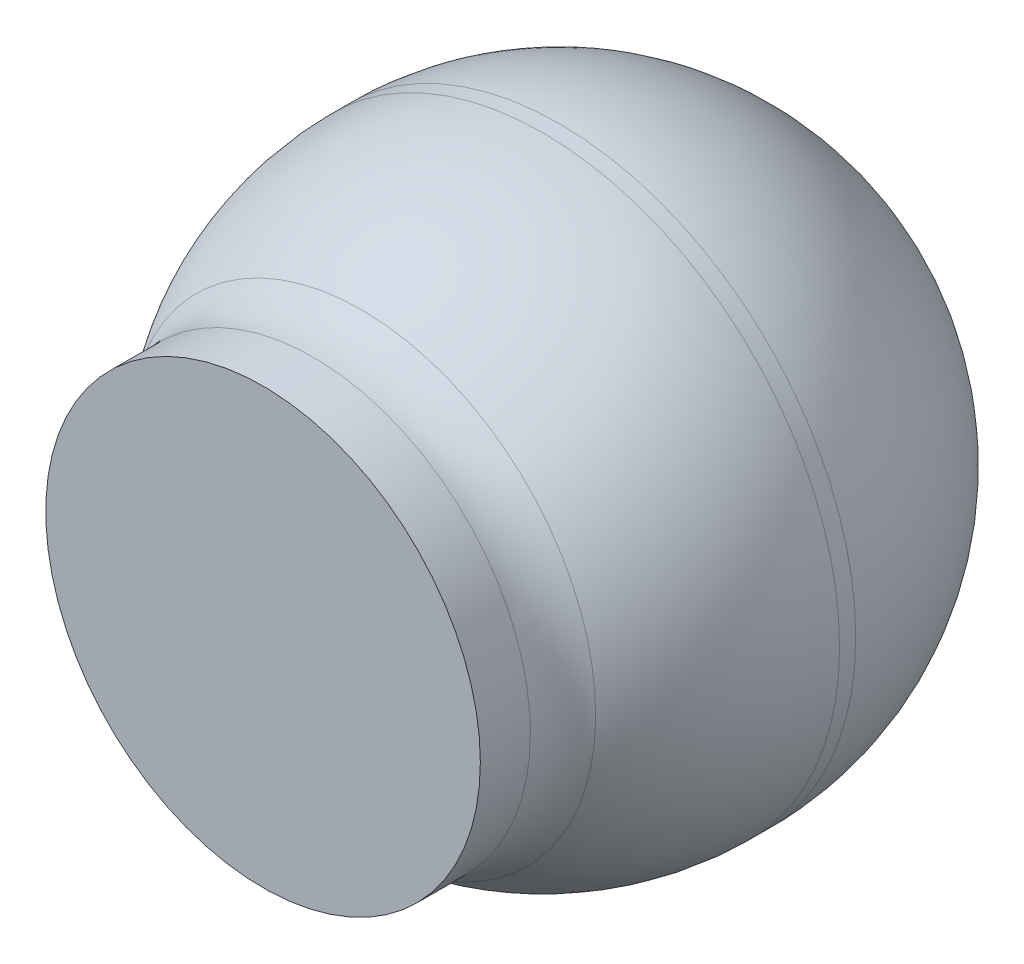
ISO-10303-21;
HEADER;
FILE_DESCRIPTION(('STEP AP214'),'2;1');
FILE_NAME('part.step','',(''),(''),'','','');
FILE_SCHEMA(('AUTOMOTIVE_DESIGN { 1 0 10303 214 1 1 1 1 }'));
ENDSEC;
DATA;
#1=APPLICATION_CONTEXT('core data for automotive mechanical design processes');
#2=APPLICATION_PROTOCOL_DEFINITION('international standard','automotive_design',2000,#1);
#3=PRODUCT_CONTEXT('',#1,'mechanical');
#4=PRODUCT('Part','Part','',(#3));
#5=PRODUCT_RELATED_PRODUCT_CATEGORY('part','',(#4));
#6=PRODUCT_DEFINITION_FORMATION('','',#4);
#7=PRODUCT_DEFINITION_CONTEXT('part definition',#1,'design');
#8=PRODUCT_DEFINITION('design','',#6,#7);
#9=PRODUCT_DEFINITION_SHAPE('','',#8);
#10=(LENGTH_UNIT() NAMED_UNIT(*) SI_UNIT(.MILLI.,.METRE.));
#11=(NAMED_UNIT(*) PLANE_ANGLE_UNIT() SI_UNIT($,.RADIAN.));
#12=(NAMED_UNIT(*) SI_UNIT($,.STERADIAN.) SOLID_ANGLE_UNIT());
#13=UNCERTAINTY_MEASURE_WITH_UNIT(LENGTH_MEASURE(1.E-05),#10,'distance_accuracy_value','');
#14=(GEOMETRIC_REPRESENTATION_CONTEXT(3) GLOBAL_UNCERTAINTY_ASSIGNED_CONTEXT((#13)) GLOBAL_UNIT_ASSIGNED_CONTEXT((#10,
#11,#12)) REPRESENTATION_CONTEXT('',''));
#15=CARTESIAN_POINT('',(0.,0.,0.));
#16=DIRECTION('',(0.,0.,1.));
#17=DIRECTION('',(1.,0.,0.));
#18=AXIS2_PLACEMENT_3D('',#15,#16,#17);
#19=CARTESIAN_POINT('',(-9.452919922269,-1.511349291452,10.006534503384));
#20=DIRECTION('',(0.,0.,-1.));
#21=DIRECTION('',(-1.,0.,0.));
#22=AXIS2_PLACEMENT_3D('',#19,#20,#21);
#23=PLANE('',#22);
#24=CARTESIAN_POINT('',(-9.452919922269,-1.511349291452,10.006534503384));
#25=DIRECTION('',(0.,0.,1.));
#26=DIRECTION('',(1.,0.,0.));
#27=AXIS2_PLACEMENT_3D('',#24,#25,#26);
#28=CIRCLE('',#27,0.275);
#29=CARTESIAN_POINT('',(-9.177919922269,-1.511349291452,10.006534503384));
#30=VERTEX_POINT('',#29);
#31=EDGE_CURVE('E20',#30,#30,#28,.F.);
#32=ORIENTED_EDGE('',*,*,#31,.F.);
#33=EDGE_LOOP('',(#32));
#34=FACE_BOUND('',#33,.T.);
#35=ADVANCED_FACE('F17',(#34),#23,.F.);
#36=CARTESIAN_POINT('',(-9.452919922269,-1.511349291452,9.906534503384));
#37=DIRECTION('',(0.,0.,1.));
#38=DIRECTION('',(1.,0.,0.));
#39=AXIS2_PLACEMENT_3D('',#36,#37,#38);
#40=CYLINDRICAL_SURFACE('',#39,0.275);
#41=CARTESIAN_POINT('',(-9.452919922269,-1.511349291452,9.943180457728));
#42=DIRECTION('',(0.,0.,-1.));
#43=DIRECTION('',(0.996700902337582,0.081162252799246,0.));
#44=AXIS2_PLACEMENT_3D('',#41,#42,#43);
#45=CIRCLE('',#44,0.275000000000001);
#46=CARTESIAN_POINT('',(-9.17882717412617,-1.48902967193221,9.943180457728));
#47=VERTEX_POINT('',#46);
#48=EDGE_CURVE('E65',#47,#47,#45,.F.);
#49=ORIENTED_EDGE('',*,*,#48,.T.);
#50=EDGE_LOOP('',(#49));
#51=FACE_BOUND('',#50,.T.);
#52=ORIENTED_EDGE('',*,*,#31,.T.);
#53=EDGE_LOOP('',(#52));
#54=FACE_BOUND('',#53,.T.);
#55=ADVANCED_FACE('F62',(#51,#54),#40,.T.);
#56=CARTESIAN_POINT('',(-9.452919922269,-1.511349291452,9.943180457728));
#57=DIRECTION('',(0.,0.,-1.));
#58=DIRECTION('',(0.996700902337583,0.081162252799246,0.));
#59=AXIS2_PLACEMENT_3D('',#56,#57,#58);
#60=TOROIDAL_SURFACE('',#59,0.375,0.1);
#61=ORIENTED_EDGE('',*,*,#48,.F.);
#62=EDGE_LOOP('',(#61));
#63=FACE_BOUND('',#62,.T.);
#64=CARTESIAN_POINT('',(-9.452919922269,-1.511349291452,9.881744931236));
#65=DIRECTION('',(0.,0.,-1.));
#66=DIRECTION('',(-0.996700902337597,-0.081162252799062,0.));
#67=AXIS2_PLACEMENT_3D('',#64,#65,#66);
#68=CIRCLE('',#67,0.296097046412663);
#69=CARTESIAN_POINT('',(-9.748040115608,-1.535381194786,9.881744931236));
#70=VERTEX_POINT('',#69);
#71=EDGE_CURVE('E39',#70,#70,#68,.T.);
#72=ORIENTED_EDGE('',*,*,#71,.F.);
#73=EDGE_LOOP('',(#72));
#74=FACE_BOUND('',#73,.T.);
#75=ADVANCED_FACE('F57',(#63,#74),#60,.F.);
#76=CARTESIAN_POINT('',(-9.826682760645,-1.541785136252,9.651976062157));
#77=CARTESIAN_POINT('',(-9.826682760645,-1.541785136252,9.701461392103));
#78=CARTESIAN_POINT('',(-9.818526217348,-1.541120941579,9.750947004335));
#79=CARTESIAN_POINT('',(-9.802207085349,-1.539792059952,9.798626332798));
#80=CARTESIAN_POINT('',(-9.778341390838,-1.537848654938,9.842699544317));
#81=CARTESIAN_POINT('',(-9.748040115608,-1.535381194786,9.881744931236));
#82=(BOUNDED_CURVE() B_SPLINE_CURVE(5,(#76,#77,#78,#79,#80,#81),.UNSPECIFIED.,.F.,
.F.) B_SPLINE_CURVE_WITH_KNOTS((6,6),(0.,0.661568582165),
.UNSPECIFIED.) CURVE() GEOMETRIC_REPRESENTATION_ITEM() RATIONAL_B_SPLINE_CURVE((1.,1.,1.,1.,1.,1.)) REPRESENTATION_ITEM(''));
#83=CARTESIAN_POINT('',(-9.452919922269,-1.511349291452,9.651976062157));
#84=DIRECTION('',(0.,0.,-1.));
#85=AXIS1_PLACEMENT('',#83,#84);
#86=SURFACE_OF_REVOLUTION('',#82,#85);
#87=CARTESIAN_POINT('',(-9.452919922269,-1.511349291452,9.651976062157));
#88=DIRECTION('',(0.,0.,1.));
#89=DIRECTION('',(1.,0.,0.));
#90=AXIS2_PLACEMENT_3D('',#87,#88,#89);
#91=CIRCLE('',#90,0.375);
#92=CARTESIAN_POINT('',(-9.077919922269,-1.511349291452,9.651976062157));
#93=VERTEX_POINT('',#92);
#94=EDGE_CURVE('E36',#93,#93,#91,.F.);
#95=ORIENTED_EDGE('',*,*,#94,.F.);
#96=EDGE_LOOP('',(#95));
#97=FACE_BOUND('',#96,.T.);
#98=ORIENTED_EDGE('',*,*,#71,.T.);
#99=EDGE_LOOP('',(#98));
#100=FACE_BOUND('',#99,.T.);
#101=ADVANCED_FACE('F53',(#97,#100),#86,.F.);
#102=CARTESIAN_POINT('',(-9.452919922269,-1.511349291452,9.256534503384));
#103=DIRECTION('',(0.,0.,1.));
#104=DIRECTION('',(1.,0.,0.));
#105=AXIS2_PLACEMENT_3D('',#102,#103,#104);
#106=CYLINDRICAL_SURFACE('',#105,0.375);
#107=CARTESIAN_POINT('',(-9.452919922269,-1.511349291452,9.631534503384));
#108=DIRECTION('',(0.,0.,-1.));
#109=DIRECTION('',(0.0811622527992356,-0.996700902337583,0.));
#110=AXIS2_PLACEMENT_3D('',#107,#108,#109);
#111=CIRCLE('',#110,0.375);
#112=CARTESIAN_POINT('',(-9.42248407746929,-1.88511212982859,9.631534503384));
#113=VERTEX_POINT('',#112);
#114=CARTESIAN_POINT('',(-9.48335576706871,-1.13758645307541,9.631534503384));
#115=VERTEX_POINT('',#114);
#116=EDGE_CURVE('E11',#113,#115,#111,.T.);
#117=ORIENTED_EDGE('',*,*,#116,.F.);
#118=CARTESIAN_POINT('',(-9.452919922269,-1.511349291452,9.631534503384));
#119=DIRECTION('',(3.33436315446763E-12,2.72100352061447E-13,1.));
#120=DIRECTION('',(0.0811622527992365,-0.996700902337583,0.));
#121=AXIS2_PLACEMENT_3D('',#118,#119,#120);
#122=CIRCLE('',#121,0.375);
#123=EDGE_CURVE('E25',#115,#113,#122,.F.);
#124=ORIENTED_EDGE('',*,*,#123,.F.);
#125=EDGE_LOOP('',(#117,#124));
#126=FACE_BOUND('',#125,.T.);
#127=ORIENTED_EDGE('',*,*,#94,.T.);
#128=EDGE_LOOP('',(#127));
#129=FACE_BOUND('',#128,.T.);
#130=ADVANCED_FACE('F34',(#126,#129),#106,.T.);
#131=CARTESIAN_POINT('',(-9.452919922269,-1.511349291452,9.631534503384));
#132=DIRECTION('',(0.0811622527992361,-0.996700902337583,0.));
#133=DIRECTION('',(-0.996700902337583,-0.0811622527992361,0.));
#134=AXIS2_PLACEMENT_3D('',#131,#132,#133);
#135=SPHERICAL_SURFACE('',#134,0.375);
#136=ORIENTED_EDGE('',*,*,#123,.T.);
#137=ORIENTED_EDGE('',*,*,#116,.T.);
#138=EDGE_LOOP('',(#136,#137));
#139=FACE_BOUND('',#138,.T.);
#140=ADVANCED_FACE('F32',(#139),#135,.T.);
#141=CLOSED_SHELL('',(#35,#55,#75,#101,#130,#140));
#142=MANIFOLD_SOLID_BREP('B1',#141);
#143=ADVANCED_BREP_SHAPE_REPRESENTATION('',(#18,#142),#14);
#144=SHAPE_DEFINITION_REPRESENTATION(#9,#143);
ENDSEC;
END-ISO-10303-21;
